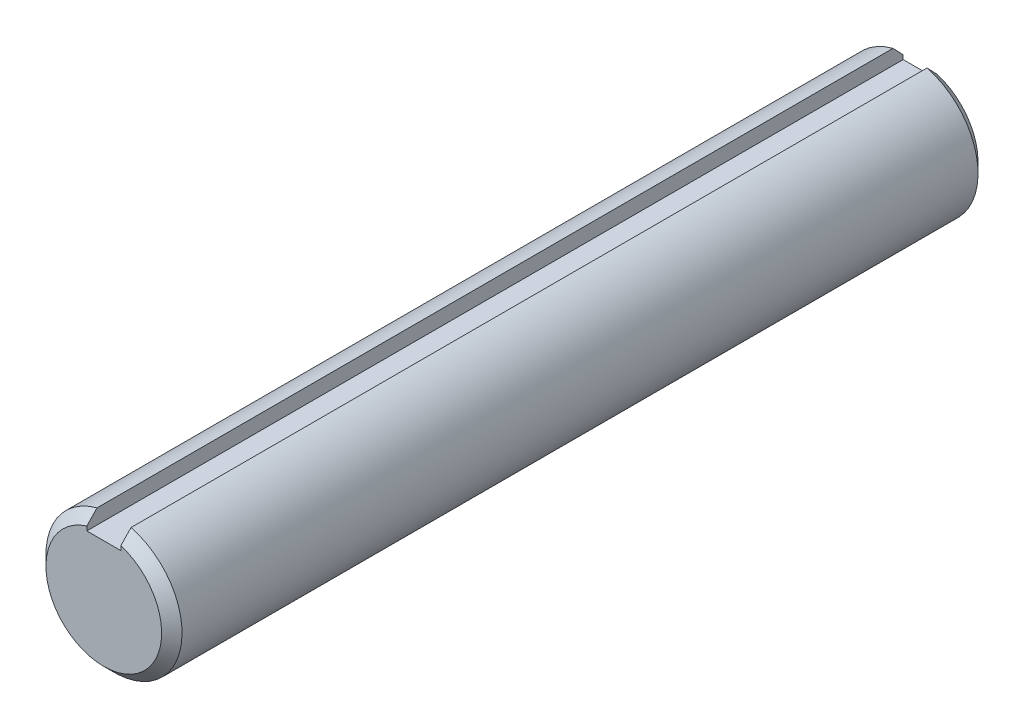
ISO-10303-21;
HEADER;
FILE_DESCRIPTION(('STEP AP214'),'2;1');
FILE_NAME('part.step','',(''),(''),'','','');
FILE_SCHEMA(('AUTOMOTIVE_DESIGN { 1 0 10303 214 1 1 1 1 }'));
ENDSEC;
DATA;
#1=APPLICATION_CONTEXT('core data for automotive mechanical design processes');
#2=APPLICATION_PROTOCOL_DEFINITION('international standard','automotive_design',2000,#1);
#3=PRODUCT_CONTEXT('',#1,'mechanical');
#4=PRODUCT('Part','Part','',(#3));
#5=PRODUCT_RELATED_PRODUCT_CATEGORY('part','',(#4));
#6=PRODUCT_DEFINITION_FORMATION('','',#4);
#7=PRODUCT_DEFINITION_CONTEXT('part definition',#1,'design');
#8=PRODUCT_DEFINITION('design','',#6,#7);
#9=PRODUCT_DEFINITION_SHAPE('','',#8);
#10=(LENGTH_UNIT() NAMED_UNIT(*) SI_UNIT(.MILLI.,.METRE.));
#11=(NAMED_UNIT(*) PLANE_ANGLE_UNIT() SI_UNIT($,.RADIAN.));
#12=(NAMED_UNIT(*) SI_UNIT($,.STERADIAN.) SOLID_ANGLE_UNIT());
#13=UNCERTAINTY_MEASURE_WITH_UNIT(LENGTH_MEASURE(1.E-05),#10,'distance_accuracy_value','');
#14=(GEOMETRIC_REPRESENTATION_CONTEXT(3) GLOBAL_UNCERTAINTY_ASSIGNED_CONTEXT((#13)) GLOBAL_UNIT_ASSIGNED_CONTEXT((#10,
#11,#12)) REPRESENTATION_CONTEXT('',''));
#15=CARTESIAN_POINT('',(0.,0.,0.));
#16=DIRECTION('',(0.,0.,1.));
#17=DIRECTION('',(1.,0.,0.));
#18=AXIS2_PLACEMENT_3D('',#15,#16,#17);
#19=CARTESIAN_POINT('',(0.,0.,38.1));
#20=DIRECTION('',(0.,0.,-1.));
#21=DIRECTION('',(-1.,0.,0.));
#22=AXIS2_PLACEMENT_3D('',#19,#20,#21);
#23=CYLINDRICAL_SURFACE('',#22,6.35);
#24=CARTESIAN_POINT('',(0.,0.,37.1475));
#25=DIRECTION('',(0.,0.,1.));
#26=DIRECTION('',(1.,0.,0.));
#27=AXIS2_PLACEMENT_3D('',#24,#25,#26);
#28=CIRCLE('',#27,6.35);
#29=CARTESIAN_POINT('',(1.5875,6.14836106210427,37.1475));
#30=VERTEX_POINT('',#29);
#31=CARTESIAN_POINT('',(-1.5875,6.14836106210427,37.1475));
#32=VERTEX_POINT('',#31);
#33=EDGE_CURVE('E154',#30,#32,#28,.F.);
#34=ORIENTED_EDGE('',*,*,#33,.T.);
#35=DIRECTION('',(0.,0.,-1.));
#36=VECTOR('',#35,1.);
#37=CARTESIAN_POINT('',(-1.5875,6.14836106210427,38.1));
#38=LINE('',#37,#36);
#39=CARTESIAN_POINT('',(-1.5875,6.14836106210427,-37.1474999999999));
#40=VERTEX_POINT('',#39);
#41=EDGE_CURVE('E131',#32,#40,#38,.T.);
#42=ORIENTED_EDGE('',*,*,#41,.T.);
#43=CARTESIAN_POINT('',(0.,0.,-37.1474999999999));
#44=DIRECTION('',(0.,0.,1.));
#45=DIRECTION('',(1.,0.,0.));
#46=AXIS2_PLACEMENT_3D('',#43,#44,#45);
#47=CIRCLE('',#46,6.35);
#48=CARTESIAN_POINT('',(1.5875,6.14836106210427,-37.1474999999999));
#49=VERTEX_POINT('',#48);
#50=EDGE_CURVE('E151',#40,#49,#47,.T.);
#51=ORIENTED_EDGE('',*,*,#50,.T.);
#52=DIRECTION('',(0.,0.,-1.));
#53=VECTOR('',#52,1.);
#54=CARTESIAN_POINT('',(1.5875,6.14836106210427,38.1));
#55=LINE('',#54,#53);
#56=EDGE_CURVE('E120',#49,#30,#55,.F.);
#57=ORIENTED_EDGE('',*,*,#56,.T.);
#58=EDGE_LOOP('',(#34,#42,#51,#57));
#59=FACE_BOUND('',#58,.T.);
#60=ADVANCED_FACE('F34',(#59),#23,.T.);
#61=CARTESIAN_POINT('',(0.,0.,38.1));
#62=DIRECTION('',(0.,0.,1.));
#63=DIRECTION('',(1.,0.,0.));
#64=AXIS2_PLACEMENT_3D('',#61,#62,#63);
#65=PLANE('',#64);
#66=DIRECTION('',(0.,-1.,0.));
#67=VECTOR('',#66,1.);
#68=CARTESIAN_POINT('',(-1.5875,6.35,38.1));
#69=LINE('',#68,#67);
#70=CARTESIAN_POINT('',(-1.5875,5.15876438694387,38.1));
#71=VERTEX_POINT('',#70);
#72=CARTESIAN_POINT('',(-1.5875,4.7625,38.1));
#73=VERTEX_POINT('',#72);
#74=EDGE_CURVE('E90',#71,#73,#69,.T.);
#75=ORIENTED_EDGE('',*,*,#74,.F.);
#76=CARTESIAN_POINT('',(0.,0.,38.1));
#77=DIRECTION('',(0.,0.,1.));
#78=DIRECTION('',(1.,0.,0.));
#79=AXIS2_PLACEMENT_3D('',#76,#77,#78);
#80=CIRCLE('',#79,5.39750000000003);
#81=CARTESIAN_POINT('',(1.5875,5.15876438694387,38.1));
#82=VERTEX_POINT('',#81);
#83=EDGE_CURVE('E146',#71,#82,#80,.T.);
#84=ORIENTED_EDGE('',*,*,#83,.T.);
#85=DIRECTION('',(0.,1.,0.));
#86=VECTOR('',#85,1.);
#87=CARTESIAN_POINT('',(1.5875,6.35,38.1));
#88=LINE('',#87,#86);
#89=CARTESIAN_POINT('',(1.5875,4.7625,38.1));
#90=VERTEX_POINT('',#89);
#91=EDGE_CURVE('E55',#90,#82,#88,.T.);
#92=ORIENTED_EDGE('',*,*,#91,.F.);
#93=DIRECTION('',(1.,0.,0.));
#94=VECTOR('',#93,1.);
#95=CARTESIAN_POINT('',(-1.5875,4.7625,38.1));
#96=LINE('',#95,#94);
#97=EDGE_CURVE('E100',#73,#90,#96,.T.);
#98=ORIENTED_EDGE('',*,*,#97,.F.);
#99=EDGE_LOOP('',(#75,#84,#92,#98));
#100=FACE_BOUND('',#99,.T.);
#101=ADVANCED_FACE('F111',(#100),#65,.T.);
#102=CARTESIAN_POINT('',(0.,0.,-38.1));
#103=DIRECTION('',(0.,0.,1.));
#104=DIRECTION('',(1.,0.,0.));
#105=AXIS2_PLACEMENT_3D('',#102,#103,#104);
#106=PLANE('',#105);
#107=CARTESIAN_POINT('',(0.,0.,-38.1));
#108=DIRECTION('',(0.,0.,1.));
#109=DIRECTION('',(1.,0.,0.));
#110=AXIS2_PLACEMENT_3D('',#107,#108,#109);
#111=CIRCLE('',#110,5.39749999999991);
#112=CARTESIAN_POINT('',(1.5875,5.15876438694374,-38.1));
#113=VERTEX_POINT('',#112);
#114=CARTESIAN_POINT('',(-1.5875,5.15876438694374,-38.1));
#115=VERTEX_POINT('',#114);
#116=EDGE_CURVE('E148',#113,#115,#111,.F.);
#117=ORIENTED_EDGE('',*,*,#116,.T.);
#118=DIRECTION('',(0.,-1.,0.));
#119=VECTOR('',#118,1.);
#120=CARTESIAN_POINT('',(-1.5875,6.35,-38.1));
#121=LINE('',#120,#119);
#122=CARTESIAN_POINT('',(-1.5875,4.7625,-38.1));
#123=VERTEX_POINT('',#122);
#124=EDGE_CURVE('E113',#115,#123,#121,.T.);
#125=ORIENTED_EDGE('',*,*,#124,.T.);
#126=DIRECTION('',(1.,0.,0.));
#127=VECTOR('',#126,1.);
#128=CARTESIAN_POINT('',(-1.5875,4.7625,-38.1));
#129=LINE('',#128,#127);
#130=CARTESIAN_POINT('',(1.5875,4.7625,-38.1));
#131=VERTEX_POINT('',#130);
#132=EDGE_CURVE('E106',#123,#131,#129,.T.);
#133=ORIENTED_EDGE('',*,*,#132,.T.);
#134=DIRECTION('',(0.,1.,0.));
#135=VECTOR('',#134,1.);
#136=CARTESIAN_POINT('',(1.5875,6.35,-38.1));
#137=LINE('',#136,#135);
#138=EDGE_CURVE('E109',#131,#113,#137,.T.);
#139=ORIENTED_EDGE('',*,*,#138,.T.);
#140=EDGE_LOOP('',(#117,#125,#133,#139));
#141=FACE_BOUND('',#140,.T.);
#142=ADVANCED_FACE('F166',(#141),#106,.F.);
#143=CARTESIAN_POINT('',(0.,0.,-37.1474999999999));
#144=DIRECTION('',(0.,0.,1.));
#145=DIRECTION('',(1.,0.,0.));
#146=AXIS2_PLACEMENT_3D('',#143,#144,#145);
#147=CONICAL_SURFACE('',#146,6.35,0.785398163397448);
#148=CARTESIAN_POINT('',(-1.5875,2.50467512422007,-40.5321073231548));
#149=CARTESIAN_POINT('',(-1.5875,2.61995748799083,-40.4346705663947));
#150=CARTESIAN_POINT('',(-1.5875,2.73434819416607,-40.3361940960173));
#151=CARTESIAN_POINT('',(-1.5875,2.96171067705,-40.1376318023626));
#152=CARTESIAN_POINT('',(-1.5875,3.07468256144116,-40.0375461025497));
#153=CARTESIAN_POINT('',(-1.5875,3.29956921576396,-39.8362383617078));
#154=CARTESIAN_POINT('',(-1.5875,3.41148417069846,-39.7350165265981));
#155=CARTESIAN_POINT('',(-1.5875,3.63450717009296,-39.5316835974312));
#156=CARTESIAN_POINT('',(-1.5875,3.74561519672358,-39.4295724838341));
#157=CARTESIAN_POINT('',(-1.5875,4.07794041463343,-39.122275163923));
#158=CARTESIAN_POINT('',(-1.5875,4.29821694512228,-38.9160724676453));
#159=CARTESIAN_POINT('',(-1.5875,4.73715914530379,-38.5019423042723));
#160=CARTESIAN_POINT('',(-1.5875,4.95582472940176,-38.2940147467597));
#161=CARTESIAN_POINT('',(-1.5875,5.39197585155531,-37.8770487299095));
#162=CARTESIAN_POINT('',(-1.5875,5.60946170363257,-37.6680105987989));
#163=CARTESIAN_POINT('',(-1.5875,6.04362892921901,-37.2491110156674));
#164=CARTESIAN_POINT('',(-1.5875,6.26031032050704,-37.0392495820551));
#165=CARTESIAN_POINT('',(-1.5875,6.69313054205312,-36.6188746527964));
#166=CARTESIAN_POINT('',(-1.5875,6.90926924461323,-36.4083610257473));
#167=CARTESIAN_POINT('',(-1.5875,7.34108970538697,-35.9868665375563));
#168=CARTESIAN_POINT('',(-1.5875,7.55677146466177,-35.7758856775018));
#169=CARTESIAN_POINT('',(-1.5875,7.77229162734195,-35.5647404933434));
#170=B_SPLINE_CURVE_WITH_KNOTS('',3,(#148,#149,#150,#151,#152,#153,#154,#155,#156,#157,#158,
#159,#160,#161,#162,#163,#164,#165,#166,#167,#168,#169),.UNSPECIFIED.,.F.,.F.,(4,2,2,2,2,2,2,2,
2,2,4),(0.,0.452810247519135,0.905585918444125,1.35828081011676,1.81098567399957,
2.7161602553463,3.62138258954868,4.5263508176059,5.43129892508634,6.3364430635277,
7.2415850976004),.UNSPECIFIED.);
#171=EDGE_CURVE('E63',#115,#40,#170,.T.);
#172=ORIENTED_EDGE('',*,*,#171,.F.);
#173=ORIENTED_EDGE('',*,*,#116,.F.);
#174=CARTESIAN_POINT('',(1.5875,7.77229162734195,-35.5647404933434));
#175=CARTESIAN_POINT('',(1.5875,7.55677146466177,-35.7758856775018));
#176=CARTESIAN_POINT('',(1.5875,7.34108970538697,-35.9868665375563));
#177=CARTESIAN_POINT('',(1.5875,6.90926924461323,-36.4083610257473));
#178=CARTESIAN_POINT('',(1.5875,6.69313054205312,-36.6188746527964));
#179=CARTESIAN_POINT('',(1.5875,6.26031032050704,-37.0392495820551));
#180=CARTESIAN_POINT('',(1.5875,6.04362892921901,-37.2491110156674));
#181=CARTESIAN_POINT('',(1.5875,5.60946170363257,-37.6680105987989));
#182=CARTESIAN_POINT('',(1.5875,5.39197585155531,-37.8770487299095));
#183=CARTESIAN_POINT('',(1.5875,4.95582472940176,-38.2940147467597));
#184=CARTESIAN_POINT('',(1.5875,4.73715914530379,-38.5019423042723));
#185=CARTESIAN_POINT('',(1.5875,4.29821694512228,-38.9160724676453));
#186=CARTESIAN_POINT('',(1.5875,4.07794041463343,-39.122275163923));
#187=CARTESIAN_POINT('',(1.5875,3.74561519672358,-39.4295724838341));
#188=CARTESIAN_POINT('',(1.5875,3.63450717009296,-39.5316835974312));
#189=CARTESIAN_POINT('',(1.5875,3.41148417069846,-39.7350165265981));
#190=CARTESIAN_POINT('',(1.5875,3.29956921576396,-39.8362383617078));
#191=CARTESIAN_POINT('',(1.5875,3.07468256144116,-40.0375461025497));
#192=CARTESIAN_POINT('',(1.5875,2.96171067705,-40.1376318023626));
#193=CARTESIAN_POINT('',(1.5875,2.73434819416607,-40.3361940960173));
#194=CARTESIAN_POINT('',(1.5875,2.61995748799083,-40.4346705663947));
#195=CARTESIAN_POINT('',(1.5875,2.50467512422007,-40.5321073231548));
#196=B_SPLINE_CURVE_WITH_KNOTS('',3,(#174,#175,#176,#177,#178,#179,#180,#181,#182,#183,#184,
#185,#186,#187,#188,#189,#190,#191,#192,#193,#194,#195),.UNSPECIFIED.,.F.,.F.,(4,2,2,2,2,2,2,2,
2,2,4),(0.,0.905142034072699,1.81028617251405,2.71523427999449,3.62020250805172,4.5254248422541,
5.43059942360083,5.88330428748363,6.33599917915627,6.78877485008126,7.2415850976004),.UNSPECIFIED.);
#197=EDGE_CURVE('E124',#49,#113,#196,.T.);
#198=ORIENTED_EDGE('',*,*,#197,.F.);
#199=ORIENTED_EDGE('',*,*,#50,.F.);
#200=EDGE_LOOP('',(#172,#173,#198,#199));
#201=FACE_BOUND('',#200,.T.);
#202=ADVANCED_FACE('F133',(#201),#147,.T.);
#203=CARTESIAN_POINT('',(0.,0.,38.1));
#204=DIRECTION('',(0.,0.,-1.));
#205=DIRECTION('',(-1.,0.,0.));
#206=AXIS2_PLACEMENT_3D('',#203,#204,#205);
#207=CONICAL_SURFACE('',#206,5.39750000000003,0.785398163397448);
#208=CARTESIAN_POINT('',(-1.5875,7.77229162734194,35.5647404933435));
#209=CARTESIAN_POINT('',(-1.5875,7.55677146466177,35.775885677502));
#210=CARTESIAN_POINT('',(-1.5875,7.34108970538697,35.9868665375564));
#211=CARTESIAN_POINT('',(-1.5875,6.90926924461324,36.4083610257474));
#212=CARTESIAN_POINT('',(-1.5875,6.69313054205314,36.6188746527965));
#213=CARTESIAN_POINT('',(-1.5875,6.26031032050706,37.0392495820552));
#214=CARTESIAN_POINT('',(-1.5875,6.04362892921904,37.2491110156675));
#215=CARTESIAN_POINT('',(-1.5875,5.60946170363261,37.668010598799));
#216=CARTESIAN_POINT('',(-1.5875,5.39197585155535,37.8770487299096));
#217=CARTESIAN_POINT('',(-1.5875,4.95582472940181,38.2940147467598));
#218=CARTESIAN_POINT('',(-1.5875,4.73715914530385,38.5019423042723));
#219=CARTESIAN_POINT('',(-1.5875,4.29821694512235,38.9160724676454));
#220=CARTESIAN_POINT('',(-1.5875,4.0779404146335,39.122275163923));
#221=CARTESIAN_POINT('',(-1.5875,3.74561519672367,39.4295724838341));
#222=CARTESIAN_POINT('',(-1.5875,3.63450717009305,39.5316835974313));
#223=CARTESIAN_POINT('',(-1.5875,3.41148417069856,39.7350165265982));
#224=CARTESIAN_POINT('',(-1.5875,3.29956921576405,39.8362383617079));
#225=CARTESIAN_POINT('',(-1.5875,3.07468256144125,40.0375461025497));
#226=CARTESIAN_POINT('',(-1.5875,2.9617106770501,40.1376318023627));
#227=CARTESIAN_POINT('',(-1.5875,2.73434819416618,40.3361940960174));
#228=CARTESIAN_POINT('',(-1.5875,2.61995748799095,40.4346705663947));
#229=CARTESIAN_POINT('',(-1.5875,2.50467512422019,40.5321073231548));
#230=B_SPLINE_CURVE_WITH_KNOTS('',3,(#208,#209,#210,#211,#212,#213,#214,#215,#216,#217,#218,
#219,#220,#221,#222,#223,#224,#225,#226,#227,#228,#229),.UNSPECIFIED.,.F.,.F.,(4,2,2,2,2,2,2,2,
2,2,4),(0.,0.905142034072683,1.81028617251402,2.71523427999444,3.62020250805164,
4.52542484225399,5.4305994236007,5.88330428748349,6.33599917915613,6.78877485008111,
7.24158509760024),.UNSPECIFIED.);
#231=EDGE_CURVE('E11',#32,#71,#230,.T.);
#232=ORIENTED_EDGE('',*,*,#231,.F.);
#233=ORIENTED_EDGE('',*,*,#33,.F.);
#234=CARTESIAN_POINT('',(1.5875,2.50467512422019,40.5321073231548));
#235=CARTESIAN_POINT('',(1.5875,2.61995748799094,40.4346705663947));
#236=CARTESIAN_POINT('',(1.5875,2.73434819416618,40.3361940960174));
#237=CARTESIAN_POINT('',(1.5875,2.9617106770501,40.1376318023627));
#238=CARTESIAN_POINT('',(1.5875,3.07468256144125,40.0375461025497));
#239=CARTESIAN_POINT('',(1.5875,3.29956921576405,39.8362383617079));
#240=CARTESIAN_POINT('',(1.5875,3.41148417069856,39.7350165265982));
#241=CARTESIAN_POINT('',(1.5875,3.63450717009305,39.5316835974313));
#242=CARTESIAN_POINT('',(1.5875,3.74561519672366,39.4295724838341));
#243=CARTESIAN_POINT('',(1.5875,4.0779404146335,39.122275163923));
#244=CARTESIAN_POINT('',(1.5875,4.29821694512235,38.9160724676454));
#245=CARTESIAN_POINT('',(1.5875,4.73715914530384,38.5019423042723));
#246=CARTESIAN_POINT('',(1.5875,4.95582472940181,38.2940147467598));
#247=CARTESIAN_POINT('',(1.5875,5.39197585155535,37.8770487299096));
#248=CARTESIAN_POINT('',(1.5875,5.60946170363261,37.668010598799));
#249=CARTESIAN_POINT('',(1.5875,6.04362892921904,37.2491110156675));
#250=CARTESIAN_POINT('',(1.5875,6.26031032050706,37.0392495820552));
#251=CARTESIAN_POINT('',(1.5875,6.69313054205314,36.6188746527965));
#252=CARTESIAN_POINT('',(1.5875,6.90926924461324,36.4083610257474));
#253=CARTESIAN_POINT('',(1.5875,7.34108970538697,35.9868665375564));
#254=CARTESIAN_POINT('',(1.5875,7.55677146466177,35.775885677502));
#255=CARTESIAN_POINT('',(1.5875,7.77229162734194,35.5647404933435));
#256=B_SPLINE_CURVE_WITH_KNOTS('',3,(#234,#235,#236,#237,#238,#239,#240,#241,#242,#243,#244,
#245,#246,#247,#248,#249,#250,#251,#252,#253,#254,#255),.UNSPECIFIED.,.F.,.F.,(4,2,2,2,2,2,2,2,
2,2,4),(0.,0.452810247519121,0.905585918444104,1.35828081011673,1.81098567399952,
2.71616025534624,3.6213825895486,4.5263508176058,5.43129892508622,6.33644306352756,
7.24158509760024),.UNSPECIFIED.);
#257=EDGE_CURVE('E48',#82,#30,#256,.T.);
#258=ORIENTED_EDGE('',*,*,#257,.F.);
#259=ORIENTED_EDGE('',*,*,#83,.F.);
#260=EDGE_LOOP('',(#232,#233,#258,#259));
#261=FACE_BOUND('',#260,.T.);
#262=ADVANCED_FACE('F36',(#261),#207,.T.);
#263=CARTESIAN_POINT('',(-1.5875,6.35,-38.1));
#264=DIRECTION('',(-1.,0.,0.));
#265=DIRECTION('',(0.,-1.,0.));
#266=AXIS2_PLACEMENT_3D('',#263,#264,#265);
#267=PLANE('',#266);
#268=ORIENTED_EDGE('',*,*,#171,.T.);
#269=ORIENTED_EDGE('',*,*,#41,.F.);
#270=ORIENTED_EDGE('',*,*,#231,.T.);
#271=ORIENTED_EDGE('',*,*,#74,.T.);
#272=DIRECTION('',(0.,0.,1.));
#273=VECTOR('',#272,1.);
#274=CARTESIAN_POINT('',(-1.5875,4.7625,-38.1));
#275=LINE('',#274,#273);
#276=EDGE_CURVE('E93',#123,#73,#275,.T.);
#277=ORIENTED_EDGE('',*,*,#276,.F.);
#278=ORIENTED_EDGE('',*,*,#124,.F.);
#279=EDGE_LOOP('',(#268,#269,#270,#271,#277,#278));
#280=FACE_BOUND('',#279,.T.);
#281=ADVANCED_FACE('F92',(#280),#267,.F.);
#282=CARTESIAN_POINT('',(1.5875,6.35,-38.1));
#283=DIRECTION('',(1.,0.,0.));
#284=DIRECTION('',(0.,1.,0.));
#285=AXIS2_PLACEMENT_3D('',#282,#283,#284);
#286=PLANE('',#285);
#287=ORIENTED_EDGE('',*,*,#197,.T.);
#288=ORIENTED_EDGE('',*,*,#138,.F.);
#289=DIRECTION('',(0.,0.,1.));
#290=VECTOR('',#289,1.);
#291=CARTESIAN_POINT('',(1.5875,4.7625,-38.1));
#292=LINE('',#291,#290);
#293=EDGE_CURVE('E108',#131,#90,#292,.T.);
#294=ORIENTED_EDGE('',*,*,#293,.T.);
#295=ORIENTED_EDGE('',*,*,#91,.T.);
#296=ORIENTED_EDGE('',*,*,#257,.T.);
#297=ORIENTED_EDGE('',*,*,#56,.F.);
#298=EDGE_LOOP('',(#287,#288,#294,#295,#296,#297));
#299=FACE_BOUND('',#298,.T.);
#300=ADVANCED_FACE('F136',(#299),#286,.F.);
#301=CARTESIAN_POINT('',(-1.5875,4.7625,-38.1));
#302=DIRECTION('',(0.,-1.,0.));
#303=DIRECTION('',(0.,0.,-1.));
#304=AXIS2_PLACEMENT_3D('',#301,#302,#303);
#305=PLANE('',#304);
#306=ORIENTED_EDGE('',*,*,#293,.F.);
#307=ORIENTED_EDGE('',*,*,#132,.F.);
#308=ORIENTED_EDGE('',*,*,#276,.T.);
#309=ORIENTED_EDGE('',*,*,#97,.T.);
#310=EDGE_LOOP('',(#306,#307,#308,#309));
#311=FACE_BOUND('',#310,.T.);
#312=ADVANCED_FACE('F104',(#311),#305,.F.);
#313=CLOSED_SHELL('',(#60,#101,#142,#202,#262,#281,#300,#312));
#314=MANIFOLD_SOLID_BREP('B2',#313);
#315=ADVANCED_BREP_SHAPE_REPRESENTATION('',(#18,#314),#14);
#316=SHAPE_DEFINITION_REPRESENTATION(#9,#315);
ENDSEC;
END-ISO-10303-21;
